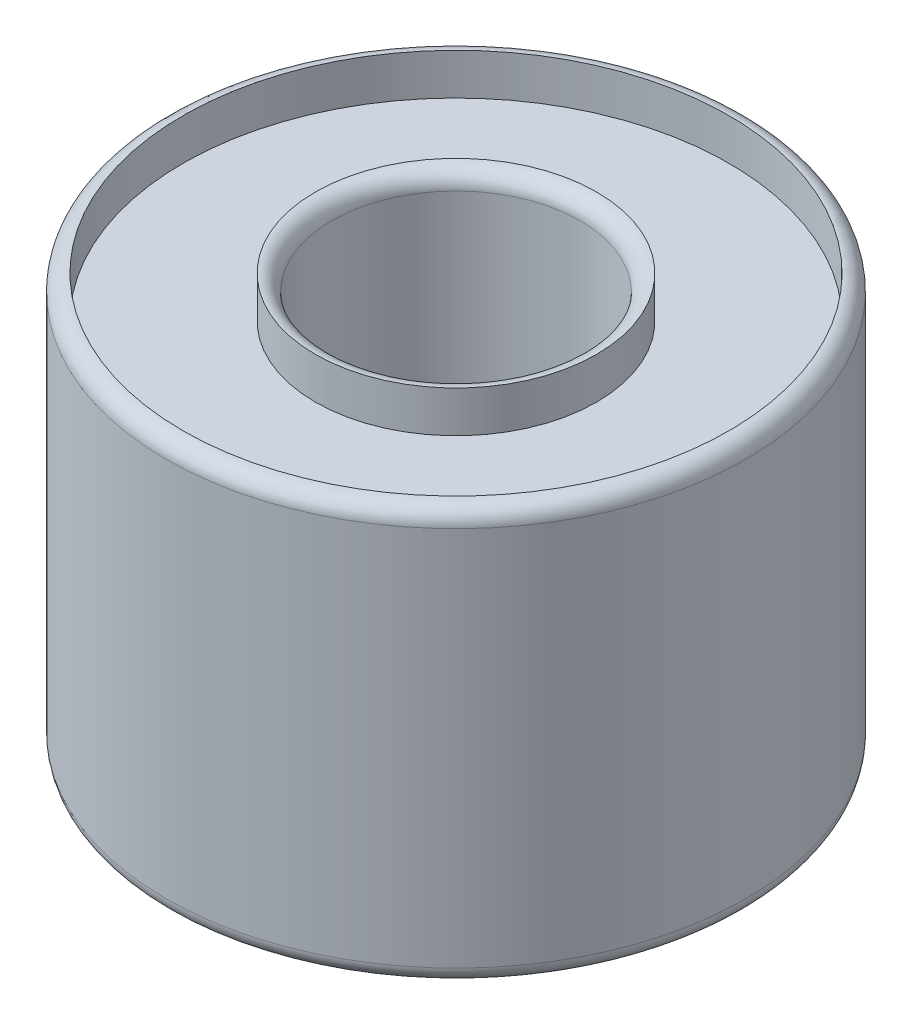
ISO-10303-21;
HEADER;
FILE_DESCRIPTION(('STEP AP214'),'2;1');
FILE_NAME('part.step','',(''),(''),'','','');
FILE_SCHEMA(('AUTOMOTIVE_DESIGN { 1 0 10303 214 1 1 1 1 }'));
ENDSEC;
DATA;
#1=APPLICATION_CONTEXT('core data for automotive mechanical design processes');
#2=APPLICATION_PROTOCOL_DEFINITION('international standard','automotive_design',2000,#1);
#3=PRODUCT_CONTEXT('',#1,'mechanical');
#4=PRODUCT('Part','Part','',(#3));
#5=PRODUCT_RELATED_PRODUCT_CATEGORY('part','',(#4));
#6=PRODUCT_DEFINITION_FORMATION('','',#4);
#7=PRODUCT_DEFINITION_CONTEXT('part definition',#1,'design');
#8=PRODUCT_DEFINITION('design','',#6,#7);
#9=PRODUCT_DEFINITION_SHAPE('','',#8);
#10=(LENGTH_UNIT() NAMED_UNIT(*) SI_UNIT(.MILLI.,.METRE.));
#11=(NAMED_UNIT(*) PLANE_ANGLE_UNIT() SI_UNIT($,.RADIAN.));
#12=(NAMED_UNIT(*) SI_UNIT($,.STERADIAN.) SOLID_ANGLE_UNIT());
#13=UNCERTAINTY_MEASURE_WITH_UNIT(LENGTH_MEASURE(1.E-05),#10,'distance_accuracy_value','');
#14=(GEOMETRIC_REPRESENTATION_CONTEXT(3) GLOBAL_UNCERTAINTY_ASSIGNED_CONTEXT((#13)) GLOBAL_UNIT_ASSIGNED_CONTEXT((#10,
#11,#12)) REPRESENTATION_CONTEXT('',''));
#15=CARTESIAN_POINT('',(0.,0.,0.));
#16=DIRECTION('',(0.,0.,1.));
#17=DIRECTION('',(1.,0.,0.));
#18=AXIS2_PLACEMENT_3D('',#15,#16,#17);
#19=CARTESIAN_POINT('',(0.,5.,0.));
#20=DIRECTION('',(0.,-1.,0.));
#21=DIRECTION('',(0.,0.,-1.));
#22=AXIS2_PLACEMENT_3D('',#19,#20,#21);
#23=CYLINDRICAL_SURFACE('',#22,3.5);
#24=CARTESIAN_POINT('',(0.,0.2,0.));
#25=DIRECTION('',(0.,1.,0.));
#26=DIRECTION('',(0.,0.,1.));
#27=AXIS2_PLACEMENT_3D('',#24,#25,#26);
#28=CIRCLE('',#27,3.5);
#29=CARTESIAN_POINT('',(0.,0.2,3.5));
#30=VERTEX_POINT('',#29);
#31=EDGE_CURVE('E10',#30,#30,#28,.T.);
#32=ORIENTED_EDGE('',*,*,#31,.T.);
#33=EDGE_LOOP('',(#32));
#34=FACE_BOUND('',#33,.T.);
#35=CARTESIAN_POINT('',(0.,4.8,0.));
#36=DIRECTION('',(0.,1.,0.));
#37=DIRECTION('',(0.,0.,1.));
#38=AXIS2_PLACEMENT_3D('',#35,#36,#37);
#39=CIRCLE('',#38,3.5);
#40=CARTESIAN_POINT('',(0.,4.8,3.5));
#41=VERTEX_POINT('',#40);
#42=EDGE_CURVE('E40',#41,#41,#39,.F.);
#43=ORIENTED_EDGE('',*,*,#42,.T.);
#44=EDGE_LOOP('',(#43));
#45=FACE_BOUND('',#44,.T.);
#46=ADVANCED_FACE('F33',(#34,#45),#23,.T.);
#47=CARTESIAN_POINT('',(0.,5.,0.));
#48=DIRECTION('',(0.,-1.,0.));
#49=DIRECTION('',(0.,0.,-1.));
#50=AXIS2_PLACEMENT_3D('',#47,#48,#49);
#51=CYLINDRICAL_SURFACE('',#50,1.5);
#52=CARTESIAN_POINT('',(0.,0.2,0.));
#53=DIRECTION('',(0.,1.,0.));
#54=DIRECTION('',(0.,0.,1.));
#55=AXIS2_PLACEMENT_3D('',#52,#53,#54);
#56=CIRCLE('',#55,1.5);
#57=CARTESIAN_POINT('',(0.,0.2,1.5));
#58=VERTEX_POINT('',#57);
#59=EDGE_CURVE('E44',#58,#58,#56,.F.);
#60=ORIENTED_EDGE('',*,*,#59,.T.);
#61=EDGE_LOOP('',(#60));
#62=FACE_BOUND('',#61,.T.);
#63=CARTESIAN_POINT('',(0.,4.8,0.));
#64=DIRECTION('',(0.,1.,0.));
#65=DIRECTION('',(0.,0.,1.));
#66=AXIS2_PLACEMENT_3D('',#63,#64,#65);
#67=CIRCLE('',#66,1.5);
#68=CARTESIAN_POINT('',(0.,4.8,1.5));
#69=VERTEX_POINT('',#68);
#70=EDGE_CURVE('E48',#69,#69,#67,.T.);
#71=ORIENTED_EDGE('',*,*,#70,.T.);
#72=EDGE_LOOP('',(#71));
#73=FACE_BOUND('',#72,.T.);
#74=ADVANCED_FACE('F105',(#62,#73),#51,.F.);
#75=CARTESIAN_POINT('',(0.,0.2,0.));
#76=DIRECTION('',(0.,1.,0.));
#77=DIRECTION('',(0.,0.,1.));
#78=AXIS2_PLACEMENT_3D('',#75,#76,#77);
#79=TOROIDAL_SURFACE('',#78,1.7,0.2);
#80=ORIENTED_EDGE('',*,*,#59,.F.);
#81=EDGE_LOOP('',(#80));
#82=FACE_BOUND('',#81,.T.);
#83=CARTESIAN_POINT('',(0.,0.,0.));
#84=DIRECTION('',(0.,-1.,0.));
#85=DIRECTION('',(0.,0.,-1.));
#86=AXIS2_PLACEMENT_3D('',#83,#84,#85);
#87=CIRCLE('',#86,1.7);
#88=CARTESIAN_POINT('',(0.,0.,-1.7));
#89=VERTEX_POINT('',#88);
#90=EDGE_CURVE('E72',#89,#89,#87,.T.);
#91=ORIENTED_EDGE('',*,*,#90,.T.);
#92=EDGE_LOOP('',(#91));
#93=FACE_BOUND('',#92,.T.);
#94=ADVANCED_FACE('F98',(#82,#93),#79,.T.);
#95=CARTESIAN_POINT('',(0.,0.2,0.));
#96=DIRECTION('',(0.,1.,0.));
#97=DIRECTION('',(0.,0.,1.));
#98=AXIS2_PLACEMENT_3D('',#95,#96,#97);
#99=TOROIDAL_SURFACE('',#98,3.3,0.2);
#100=CARTESIAN_POINT('',(0.,0.,0.));
#101=DIRECTION('',(0.,-1.,0.));
#102=DIRECTION('',(0.,0.,-1.));
#103=AXIS2_PLACEMENT_3D('',#100,#101,#102);
#104=CIRCLE('',#103,3.3);
#105=CARTESIAN_POINT('',(0.,0.,-3.3));
#106=VERTEX_POINT('',#105);
#107=EDGE_CURVE('E66',#106,#106,#104,.T.);
#108=ORIENTED_EDGE('',*,*,#107,.F.);
#109=EDGE_LOOP('',(#108));
#110=FACE_BOUND('',#109,.T.);
#111=ORIENTED_EDGE('',*,*,#31,.F.);
#112=EDGE_LOOP('',(#111));
#113=FACE_BOUND('',#112,.T.);
#114=ADVANCED_FACE('F94',(#110,#113),#99,.T.);
#115=CARTESIAN_POINT('',(0.,4.8,0.));
#116=DIRECTION('',(0.,1.,0.));
#117=DIRECTION('',(0.,0.,1.));
#118=AXIS2_PLACEMENT_3D('',#115,#116,#117);
#119=TOROIDAL_SURFACE('',#118,1.7,0.2);
#120=CARTESIAN_POINT('',(0.,5.,0.));
#121=DIRECTION('',(0.,1.,0.));
#122=DIRECTION('',(0.,0.,1.));
#123=AXIS2_PLACEMENT_3D('',#120,#121,#122);
#124=CIRCLE('',#123,1.7);
#125=CARTESIAN_POINT('',(0.,5.,1.7));
#126=VERTEX_POINT('',#125);
#127=EDGE_CURVE('E60',#126,#126,#124,.T.);
#128=ORIENTED_EDGE('',*,*,#127,.T.);
#129=EDGE_LOOP('',(#128));
#130=FACE_BOUND('',#129,.T.);
#131=ORIENTED_EDGE('',*,*,#70,.F.);
#132=EDGE_LOOP('',(#131));
#133=FACE_BOUND('',#132,.T.);
#134=ADVANCED_FACE('F97',(#130,#133),#119,.T.);
#135=CARTESIAN_POINT('',(0.,4.8,0.));
#136=DIRECTION('',(0.,1.,0.));
#137=DIRECTION('',(0.,0.,1.));
#138=AXIS2_PLACEMENT_3D('',#135,#136,#137);
#139=TOROIDAL_SURFACE('',#138,3.3,0.2);
#140=ORIENTED_EDGE('',*,*,#42,.F.);
#141=EDGE_LOOP('',(#140));
#142=FACE_BOUND('',#141,.T.);
#143=CARTESIAN_POINT('',(0.,5.,0.));
#144=DIRECTION('',(0.,1.,0.));
#145=DIRECTION('',(0.,0.,1.));
#146=AXIS2_PLACEMENT_3D('',#143,#144,#145);
#147=CIRCLE('',#146,3.3);
#148=CARTESIAN_POINT('',(0.,5.,3.3));
#149=VERTEX_POINT('',#148);
#150=EDGE_CURVE('E54',#149,#149,#147,.T.);
#151=ORIENTED_EDGE('',*,*,#150,.F.);
#152=EDGE_LOOP('',(#151));
#153=FACE_BOUND('',#152,.T.);
#154=ADVANCED_FACE('F35',(#142,#153),#139,.T.);
#155=CARTESIAN_POINT('',(0.,4.5,0.));
#156=DIRECTION('',(0.,1.,0.));
#157=DIRECTION('',(0.,0.,1.));
#158=AXIS2_PLACEMENT_3D('',#155,#156,#157);
#159=CYLINDRICAL_SURFACE('',#158,3.3);
#160=CARTESIAN_POINT('',(0.,4.5,0.));
#161=DIRECTION('',(0.,1.,0.));
#162=DIRECTION('',(0.,0.,1.));
#163=AXIS2_PLACEMENT_3D('',#160,#161,#162);
#164=CIRCLE('',#163,3.3);
#165=CARTESIAN_POINT('',(0.,4.5,3.3));
#166=VERTEX_POINT('',#165);
#167=EDGE_CURVE('E53',#166,#166,#164,.T.);
#168=ORIENTED_EDGE('',*,*,#167,.F.);
#169=EDGE_LOOP('',(#168));
#170=FACE_BOUND('',#169,.T.);
#171=ORIENTED_EDGE('',*,*,#150,.T.);
#172=EDGE_LOOP('',(#171));
#173=FACE_BOUND('',#172,.T.);
#174=ADVANCED_FACE('F116',(#170,#173),#159,.F.);
#175=CARTESIAN_POINT('',(0.,4.5,0.));
#176=DIRECTION('',(0.,1.,0.));
#177=DIRECTION('',(0.,0.,1.));
#178=AXIS2_PLACEMENT_3D('',#175,#176,#177);
#179=PLANE('',#178);
#180=CARTESIAN_POINT('',(0.,4.5,0.));
#181=DIRECTION('',(0.,1.,0.));
#182=DIRECTION('',(0.,0.,1.));
#183=AXIS2_PLACEMENT_3D('',#180,#181,#182);
#184=CIRCLE('',#183,1.7);
#185=CARTESIAN_POINT('',(0.,4.5,1.7));
#186=VERTEX_POINT('',#185);
#187=EDGE_CURVE('E57',#186,#186,#184,.T.);
#188=ORIENTED_EDGE('',*,*,#187,.F.);
#189=EDGE_LOOP('',(#188));
#190=FACE_BOUND('',#189,.T.);
#191=ORIENTED_EDGE('',*,*,#167,.T.);
#192=EDGE_LOOP('',(#191));
#193=FACE_BOUND('',#192,.T.);
#194=ADVANCED_FACE('F119',(#190,#193),#179,.T.);
#195=CARTESIAN_POINT('',(0.,4.5,0.));
#196=DIRECTION('',(0.,1.,0.));
#197=DIRECTION('',(0.,0.,1.));
#198=AXIS2_PLACEMENT_3D('',#195,#196,#197);
#199=CYLINDRICAL_SURFACE('',#198,1.7);
#200=ORIENTED_EDGE('',*,*,#187,.T.);
#201=EDGE_LOOP('',(#200));
#202=FACE_BOUND('',#201,.T.);
#203=ORIENTED_EDGE('',*,*,#127,.F.);
#204=EDGE_LOOP('',(#203));
#205=FACE_BOUND('',#204,.T.);
#206=ADVANCED_FACE('F90',(#202,#205),#199,.T.);
#207=CARTESIAN_POINT('',(0.,0.5,0.));
#208=DIRECTION('',(0.,-1.,0.));
#209=DIRECTION('',(0.,0.,-1.));
#210=AXIS2_PLACEMENT_3D('',#207,#208,#209);
#211=CYLINDRICAL_SURFACE('',#210,3.3);
#212=CARTESIAN_POINT('',(0.,0.5,0.));
#213=DIRECTION('',(0.,-1.,0.));
#214=DIRECTION('',(0.,0.,-1.));
#215=AXIS2_PLACEMENT_3D('',#212,#213,#214);
#216=CIRCLE('',#215,3.3);
#217=CARTESIAN_POINT('',(0.,0.5,-3.3));
#218=VERTEX_POINT('',#217);
#219=EDGE_CURVE('E63',#218,#218,#216,.T.);
#220=ORIENTED_EDGE('',*,*,#219,.F.);
#221=EDGE_LOOP('',(#220));
#222=FACE_BOUND('',#221,.T.);
#223=ORIENTED_EDGE('',*,*,#107,.T.);
#224=EDGE_LOOP('',(#223));
#225=FACE_BOUND('',#224,.T.);
#226=ADVANCED_FACE('F84',(#222,#225),#211,.F.);
#227=CARTESIAN_POINT('',(0.,0.5,0.));
#228=DIRECTION('',(0.,-1.,0.));
#229=DIRECTION('',(0.,0.,-1.));
#230=AXIS2_PLACEMENT_3D('',#227,#228,#229);
#231=PLANE('',#230);
#232=CARTESIAN_POINT('',(0.,0.5,0.));
#233=DIRECTION('',(0.,-1.,0.));
#234=DIRECTION('',(0.,0.,-1.));
#235=AXIS2_PLACEMENT_3D('',#232,#233,#234);
#236=CIRCLE('',#235,1.7);
#237=CARTESIAN_POINT('',(0.,0.5,-1.7));
#238=VERTEX_POINT('',#237);
#239=EDGE_CURVE('E69',#238,#238,#236,.T.);
#240=ORIENTED_EDGE('',*,*,#239,.F.);
#241=EDGE_LOOP('',(#240));
#242=FACE_BOUND('',#241,.T.);
#243=ORIENTED_EDGE('',*,*,#219,.T.);
#244=EDGE_LOOP('',(#243));
#245=FACE_BOUND('',#244,.T.);
#246=ADVANCED_FACE('F81',(#242,#245),#231,.T.);
#247=CARTESIAN_POINT('',(0.,0.5,0.));
#248=DIRECTION('',(0.,-1.,0.));
#249=DIRECTION('',(0.,0.,-1.));
#250=AXIS2_PLACEMENT_3D('',#247,#248,#249);
#251=CYLINDRICAL_SURFACE('',#250,1.7);
#252=ORIENTED_EDGE('',*,*,#239,.T.);
#253=EDGE_LOOP('',(#252));
#254=FACE_BOUND('',#253,.T.);
#255=ORIENTED_EDGE('',*,*,#90,.F.);
#256=EDGE_LOOP('',(#255));
#257=FACE_BOUND('',#256,.T.);
#258=ADVANCED_FACE('F78',(#254,#257),#251,.T.);
#259=CLOSED_SHELL('',(#46,#74,#94,#114,#134,#154,#174,#194,#206,#226,#246,#258));
#260=MANIFOLD_SOLID_BREP('B2',#259);
#261=ADVANCED_BREP_SHAPE_REPRESENTATION('',(#18,#260),#14);
#262=SHAPE_DEFINITION_REPRESENTATION(#9,#261);
ENDSEC;
END-ISO-10303-21;
